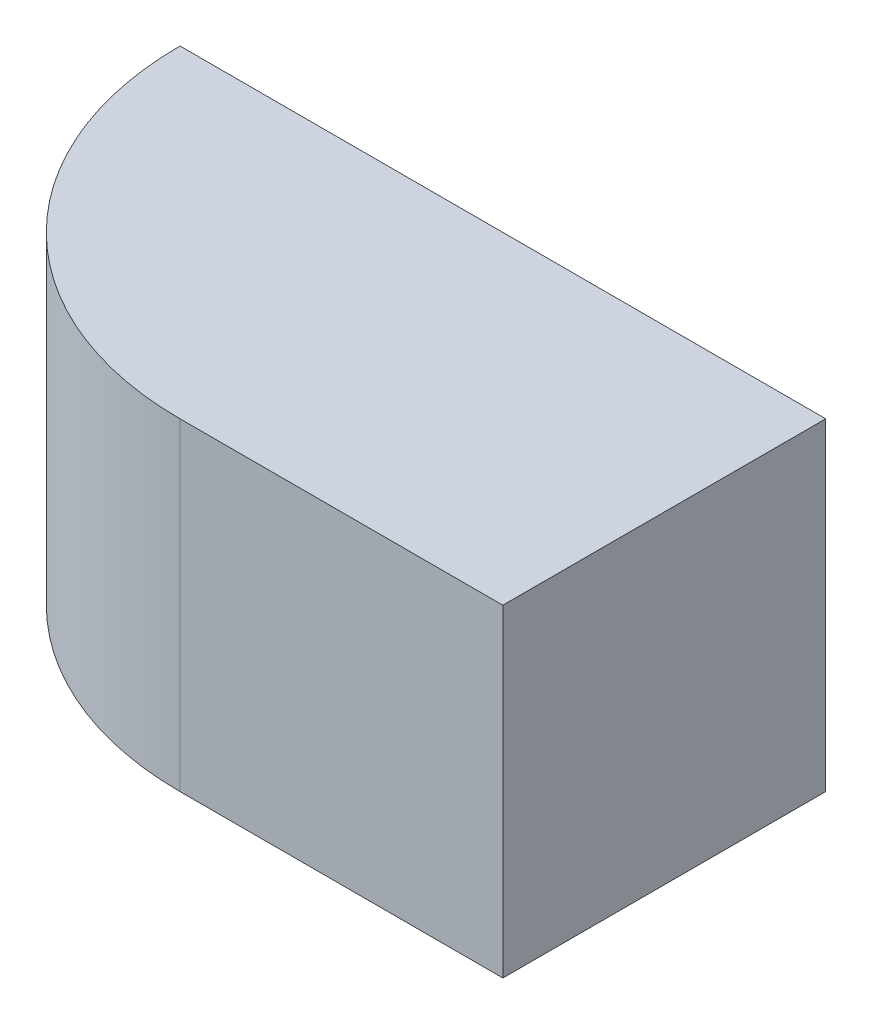
ISO-10303-21;
HEADER;
FILE_DESCRIPTION(('STEP AP214'),'2;1');
FILE_NAME('part.step','',(''),(''),'','','');
FILE_SCHEMA(('AUTOMOTIVE_DESIGN { 1 0 10303 214 1 1 1 1 }'));
ENDSEC;
DATA;
#1=APPLICATION_CONTEXT('core data for automotive mechanical design processes');
#2=APPLICATION_PROTOCOL_DEFINITION('international standard','automotive_design',2000,#1);
#3=PRODUCT_CONTEXT('',#1,'mechanical');
#4=PRODUCT('Part','Part','',(#3));
#5=PRODUCT_RELATED_PRODUCT_CATEGORY('part','',(#4));
#6=PRODUCT_DEFINITION_FORMATION('','',#4);
#7=PRODUCT_DEFINITION_CONTEXT('part definition',#1,'design');
#8=PRODUCT_DEFINITION('design','',#6,#7);
#9=PRODUCT_DEFINITION_SHAPE('','',#8);
#10=(LENGTH_UNIT() NAMED_UNIT(*) SI_UNIT(.MILLI.,.METRE.));
#11=(NAMED_UNIT(*) PLANE_ANGLE_UNIT() SI_UNIT($,.RADIAN.));
#12=(NAMED_UNIT(*) SI_UNIT($,.STERADIAN.) SOLID_ANGLE_UNIT());
#13=UNCERTAINTY_MEASURE_WITH_UNIT(LENGTH_MEASURE(1.E-05),#10,'distance_accuracy_value','');
#14=(GEOMETRIC_REPRESENTATION_CONTEXT(3) GLOBAL_UNCERTAINTY_ASSIGNED_CONTEXT((#13)) GLOBAL_UNIT_ASSIGNED_CONTEXT((#10,
#11,#12)) REPRESENTATION_CONTEXT('',''));
#15=CARTESIAN_POINT('',(0.,0.,0.));
#16=DIRECTION('',(0.,0.,1.));
#17=DIRECTION('',(1.,0.,0.));
#18=AXIS2_PLACEMENT_3D('',#15,#16,#17);
#19=CARTESIAN_POINT('',(-2.00000002980232,-8.75000013038516,2.));
#20=DIRECTION('',(0.,0.,1.));
#21=DIRECTION('',(1.,0.,0.));
#22=AXIS2_PLACEMENT_3D('',#19,#20,#21);
#23=PLANE('',#22);
#24=DIRECTION('',(-1.,0.,0.));
#25=VECTOR('',#24,1.);
#26=CARTESIAN_POINT('',(-1.50000002235174,-9.00000013411045,2.));
#27=LINE('',#26,#25);
#28=CARTESIAN_POINT('',(-1.50000002235174,-9.00000013411045,2.));
#29=VERTEX_POINT('',#28);
#30=CARTESIAN_POINT('',(-2.5000000372529,-9.00000013411045,2.));
#31=VERTEX_POINT('',#30);
#32=EDGE_CURVE('E74',#29,#31,#27,.T.);
#33=ORIENTED_EDGE('',*,*,#32,.T.);
#34=DIRECTION('',(0.,1.,0.));
#35=VECTOR('',#34,1.);
#36=CARTESIAN_POINT('',(-2.5000000372529,-9.00000013411045,2.));
#37=LINE('',#36,#35);
#38=CARTESIAN_POINT('',(-2.5000000372529,-8.50000012665987,2.));
#39=VERTEX_POINT('',#38);
#40=EDGE_CURVE('E76',#31,#39,#37,.T.);
#41=ORIENTED_EDGE('',*,*,#40,.T.);
#42=DIRECTION('',(1.,0.,0.));
#43=VECTOR('',#42,1.);
#44=CARTESIAN_POINT('',(-2.5000000372529,-8.50000012665987,2.));
#45=LINE('',#44,#43);
#46=CARTESIAN_POINT('',(-1.50000002235174,-8.50000012665987,2.));
#47=VERTEX_POINT('',#46);
#48=EDGE_CURVE('E106',#39,#47,#45,.T.);
#49=ORIENTED_EDGE('',*,*,#48,.T.);
#50=DIRECTION('',(0.,-1.,0.));
#51=VECTOR('',#50,1.);
#52=CARTESIAN_POINT('',(-1.50000002235174,-8.50000012665987,2.));
#53=LINE('',#52,#51);
#54=EDGE_CURVE('E28',#47,#29,#53,.T.);
#55=ORIENTED_EDGE('',*,*,#54,.T.);
#56=EDGE_LOOP('',(#33,#41,#49,#55));
#57=FACE_BOUND('',#56,.T.);
#58=ADVANCED_FACE('F17',(#57),#23,.F.);
#59=CARTESIAN_POINT('',(-2.00000002980232,-8.75000013038516,2.5));
#60=DIRECTION('',(0.,0.,1.));
#61=DIRECTION('',(1.,0.,0.));
#62=AXIS2_PLACEMENT_3D('',#59,#60,#61);
#63=PLANE('',#62);
#64=DIRECTION('',(0.,1.,0.));
#65=VECTOR('',#64,1.);
#66=CARTESIAN_POINT('',(-2.0000000372529,-8.62500012852252,2.5));
#67=LINE('',#66,#65);
#68=CARTESIAN_POINT('',(-2.0000000372529,-9.00000013411045,2.5));
#69=VERTEX_POINT('',#68);
#70=CARTESIAN_POINT('',(-2.0000000372529,-8.50000012665987,2.5));
#71=VERTEX_POINT('',#70);
#72=EDGE_CURVE('E91',#69,#71,#67,.T.);
#73=ORIENTED_EDGE('',*,*,#72,.F.);
#74=DIRECTION('',(1.,0.,0.));
#75=VECTOR('',#74,1.);
#76=CARTESIAN_POINT('',(-1.50000002235174,-9.00000013411045,2.5));
#77=LINE('',#76,#75);
#78=CARTESIAN_POINT('',(-1.50000002235174,-9.00000013411045,2.5));
#79=VERTEX_POINT('',#78);
#80=EDGE_CURVE('E65',#69,#79,#77,.T.);
#81=ORIENTED_EDGE('',*,*,#80,.T.);
#82=DIRECTION('',(0.,1.,0.));
#83=VECTOR('',#82,1.);
#84=CARTESIAN_POINT('',(-1.50000002235174,-8.50000012665987,2.5));
#85=LINE('',#84,#83);
#86=CARTESIAN_POINT('',(-1.50000002235174,-8.50000012665987,2.5));
#87=VERTEX_POINT('',#86);
#88=EDGE_CURVE('E11',#79,#87,#85,.T.);
#89=ORIENTED_EDGE('',*,*,#88,.T.);
#90=DIRECTION('',(-1.,0.,0.));
#91=VECTOR('',#90,1.);
#92=CARTESIAN_POINT('',(-2.5000000372529,-8.50000012665987,2.5));
#93=LINE('',#92,#91);
#94=EDGE_CURVE('E97',#87,#71,#93,.T.);
#95=ORIENTED_EDGE('',*,*,#94,.T.);
#96=EDGE_LOOP('',(#73,#81,#89,#95));
#97=FACE_BOUND('',#96,.T.);
#98=ADVANCED_FACE('F129',(#97),#63,.T.);
#99=CARTESIAN_POINT('',(-1.50000002235174,-9.00000013411045,2.));
#100=DIRECTION('',(1.,0.,0.));
#101=DIRECTION('',(0.,1.,0.));
#102=AXIS2_PLACEMENT_3D('',#99,#100,#101);
#103=PLANE('',#102);
#104=ORIENTED_EDGE('',*,*,#54,.F.);
#105=DIRECTION('',(0.,0.,1.));
#106=VECTOR('',#105,1.);
#107=CARTESIAN_POINT('',(-1.50000002235174,-8.50000012665987,2.));
#108=LINE('',#107,#106);
#109=EDGE_CURVE('E100',#47,#87,#108,.T.);
#110=ORIENTED_EDGE('',*,*,#109,.T.);
#111=ORIENTED_EDGE('',*,*,#88,.F.);
#112=DIRECTION('',(0.,0.,1.));
#113=VECTOR('',#112,1.);
#114=CARTESIAN_POINT('',(-1.50000002235174,-9.00000013411045,2.));
#115=LINE('',#114,#113);
#116=EDGE_CURVE('E79',#29,#79,#115,.T.);
#117=ORIENTED_EDGE('',*,*,#116,.F.);
#118=EDGE_LOOP('',(#104,#110,#111,#117));
#119=FACE_BOUND('',#118,.T.);
#120=ADVANCED_FACE('F127',(#119),#103,.T.);
#121=CARTESIAN_POINT('',(-1.50000002235174,-8.50000012665987,2.));
#122=DIRECTION('',(0.,1.,0.));
#123=DIRECTION('',(1.,0.,0.));
#124=AXIS2_PLACEMENT_3D('',#121,#122,#123);
#125=PLANE('',#124);
#126=CARTESIAN_POINT('',(-2.0000000372529,-8.50000012665987,2.));
#127=DIRECTION('',(0.,-1.,0.));
#128=DIRECTION('',(-0.707106781186548,0.,0.707106781186548));
#129=AXIS2_PLACEMENT_3D('',#126,#127,#128);
#130=CIRCLE('',#129,0.5);
#131=EDGE_CURVE('E21',#71,#39,#130,.T.);
#132=ORIENTED_EDGE('',*,*,#131,.F.);
#133=ORIENTED_EDGE('',*,*,#94,.F.);
#134=ORIENTED_EDGE('',*,*,#109,.F.);
#135=ORIENTED_EDGE('',*,*,#48,.F.);
#136=EDGE_LOOP('',(#132,#133,#134,#135));
#137=FACE_BOUND('',#136,.T.);
#138=ADVANCED_FACE('F19',(#137),#125,.T.);
#139=CARTESIAN_POINT('',(-2.5000000372529,-9.00000013411045,2.));
#140=DIRECTION('',(0.,-1.,0.));
#141=DIRECTION('',(0.,0.,-1.));
#142=AXIS2_PLACEMENT_3D('',#139,#140,#141);
#143=PLANE('',#142);
#144=CARTESIAN_POINT('',(-2.0000000372529,-9.00000013411045,2.));
#145=DIRECTION('',(0.,1.,0.));
#146=DIRECTION('',(-0.707106781186548,0.,0.707106781186548));
#147=AXIS2_PLACEMENT_3D('',#144,#145,#146);
#148=CIRCLE('',#147,0.5);
#149=EDGE_CURVE('E85',#31,#69,#148,.T.);
#150=ORIENTED_EDGE('',*,*,#149,.F.);
#151=ORIENTED_EDGE('',*,*,#32,.F.);
#152=ORIENTED_EDGE('',*,*,#116,.T.);
#153=ORIENTED_EDGE('',*,*,#80,.F.);
#154=EDGE_LOOP('',(#150,#151,#152,#153));
#155=FACE_BOUND('',#154,.T.);
#156=ADVANCED_FACE('F89',(#155),#143,.T.);
#157=CARTESIAN_POINT('',(-2.0000000372529,-8.62500012852252,2.));
#158=DIRECTION('',(0.,-1.,0.));
#159=DIRECTION('',(-0.707106781186548,0.,0.707106781186548));
#160=AXIS2_PLACEMENT_3D('',#157,#158,#159);
#161=CYLINDRICAL_SURFACE('',#160,0.5);
#162=ORIENTED_EDGE('',*,*,#149,.T.);
#163=ORIENTED_EDGE('',*,*,#72,.T.);
#164=ORIENTED_EDGE('',*,*,#131,.T.);
#165=ORIENTED_EDGE('',*,*,#40,.F.);
#166=EDGE_LOOP('',(#162,#163,#164,#165));
#167=FACE_BOUND('',#166,.T.);
#168=ADVANCED_FACE('F83',(#167),#161,.T.);
#169=CLOSED_SHELL('',(#58,#98,#120,#138,#156,#168));
#170=MANIFOLD_SOLID_BREP('B1',#169);
#171=ADVANCED_BREP_SHAPE_REPRESENTATION('',(#18,#170),#14);
#172=SHAPE_DEFINITION_REPRESENTATION(#9,#171);
ENDSEC;
END-ISO-10303-21;
